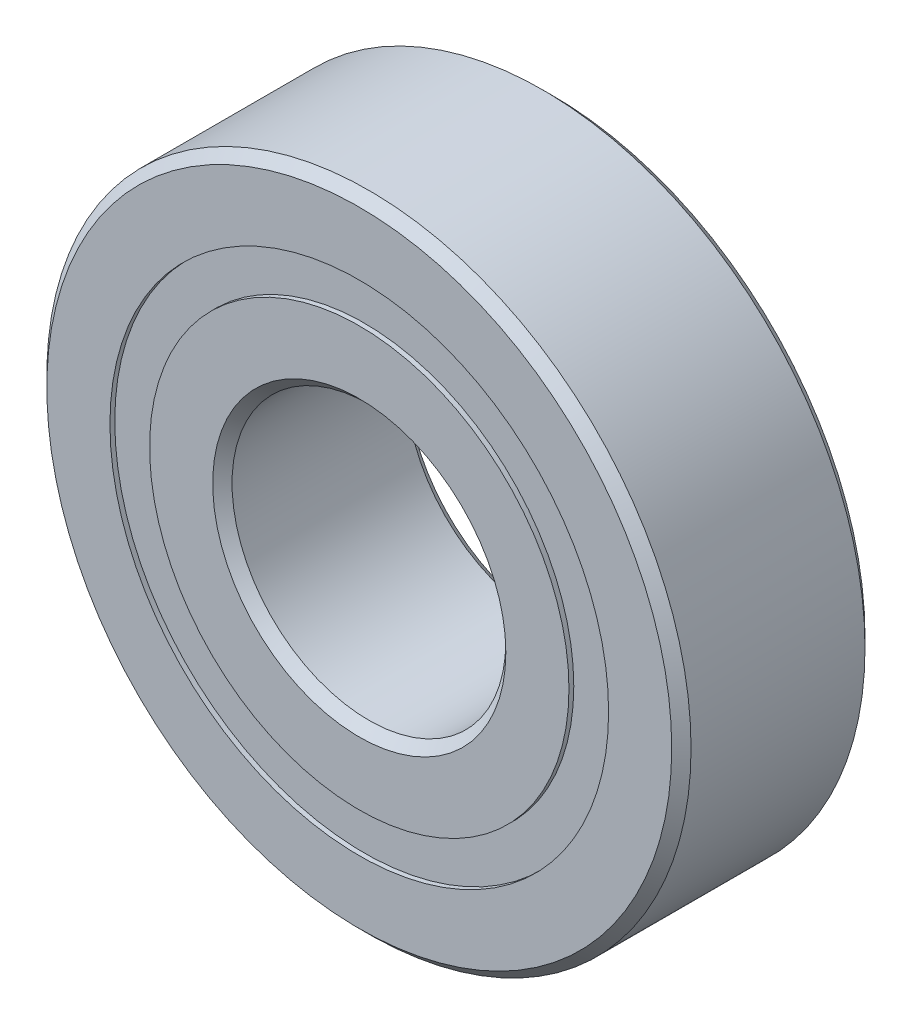
ISO-10303-21;
HEADER;
FILE_DESCRIPTION(('STEP AP214'),'2;1');
FILE_NAME('part.step','',(''),(''),'','','');
FILE_SCHEMA(('AUTOMOTIVE_DESIGN { 1 0 10303 214 1 1 1 1 }'));
ENDSEC;
DATA;
#1=APPLICATION_CONTEXT('core data for automotive mechanical design processes');
#2=APPLICATION_PROTOCOL_DEFINITION('international standard','automotive_design',2000,#1);
#3=PRODUCT_CONTEXT('',#1,'mechanical');
#4=PRODUCT('Part','Part','',(#3));
#5=PRODUCT_RELATED_PRODUCT_CATEGORY('part','',(#4));
#6=PRODUCT_DEFINITION_FORMATION('','',#4);
#7=PRODUCT_DEFINITION_CONTEXT('part definition',#1,'design');
#8=PRODUCT_DEFINITION('design','',#6,#7);
#9=PRODUCT_DEFINITION_SHAPE('','',#8);
#10=(LENGTH_UNIT() NAMED_UNIT(*) SI_UNIT(.MILLI.,.METRE.));
#11=(NAMED_UNIT(*) PLANE_ANGLE_UNIT() SI_UNIT($,.RADIAN.));
#12=(NAMED_UNIT(*) SI_UNIT($,.STERADIAN.) SOLID_ANGLE_UNIT());
#13=UNCERTAINTY_MEASURE_WITH_UNIT(LENGTH_MEASURE(1.E-05),#10,'distance_accuracy_value','');
#14=(GEOMETRIC_REPRESENTATION_CONTEXT(3) GLOBAL_UNCERTAINTY_ASSIGNED_CONTEXT((#13)) GLOBAL_UNIT_ASSIGNED_CONTEXT((#10,
#11,#12)) REPRESENTATION_CONTEXT('',''));
#15=CARTESIAN_POINT('',(0.,0.,0.));
#16=DIRECTION('',(0.,0.,1.));
#17=DIRECTION('',(1.,0.,0.));
#18=AXIS2_PLACEMENT_3D('',#15,#16,#17);
#19=CARTESIAN_POINT('',(0.,15.4807692307692,-5.70000000000001));
#20=DIRECTION('',(0.,0.,1.));
#21=DIRECTION('',(1.,0.,0.));
#22=AXIS2_PLACEMENT_3D('',#19,#20,#21);
#23=PLANE('',#22);
#24=CARTESIAN_POINT('',(0.,0.,-5.70000000000001));
#25=DIRECTION('',(0.,0.,1.));
#26=DIRECTION('',(1.,0.,0.));
#27=AXIS2_PLACEMENT_3D('',#24,#25,#26);
#28=CIRCLE('',#27,15.4807692307692);
#29=CARTESIAN_POINT('',(15.4807692307692,0.,-5.70000000000001));
#30=VERTEX_POINT('',#29);
#31=EDGE_CURVE('E58',#30,#30,#28,.T.);
#32=ORIENTED_EDGE('',*,*,#31,.F.);
#33=EDGE_LOOP('',(#32));
#34=FACE_BOUND('',#33,.T.);
#35=CARTESIAN_POINT('',(0.,0.,-5.70000000000001));
#36=DIRECTION('',(0.,0.,1.));
#37=DIRECTION('',(1.,0.,0.));
#38=AXIS2_PLACEMENT_3D('',#35,#36,#37);
#39=CIRCLE('',#38,13.0192307692308);
#40=CARTESIAN_POINT('',(13.0192307692308,0.,-5.70000000000001));
#41=VERTEX_POINT('',#40);
#42=EDGE_CURVE('E11',#41,#41,#39,.T.);
#43=ORIENTED_EDGE('',*,*,#42,.T.);
#44=EDGE_LOOP('',(#43));
#45=FACE_BOUND('',#44,.T.);
#46=ADVANCED_FACE('F44',(#34,#45),#23,.F.);
#47=CARTESIAN_POINT('',(0.,0.,6.));
#48=DIRECTION('',(0.,0.,1.));
#49=DIRECTION('',(1.,0.,0.));
#50=AXIS2_PLACEMENT_3D('',#47,#48,#49);
#51=CYLINDRICAL_SURFACE('',#50,13.0192307692308);
#52=ORIENTED_EDGE('',*,*,#42,.F.);
#53=EDGE_LOOP('',(#52));
#54=FACE_BOUND('',#53,.T.);
#55=CARTESIAN_POINT('',(0.,0.,-2.93698893605669));
#56=DIRECTION('',(0.,0.,1.));
#57=DIRECTION('',(1.,0.,0.));
#58=AXIS2_PLACEMENT_3D('',#55,#56,#57);
#59=CIRCLE('',#58,13.0192307692308);
#60=CARTESIAN_POINT('',(13.0192307692308,0.,-2.93698893605669));
#61=VERTEX_POINT('',#60);
#62=EDGE_CURVE('E50',#61,#61,#59,.T.);
#63=ORIENTED_EDGE('',*,*,#62,.T.);
#64=EDGE_LOOP('',(#63));
#65=FACE_BOUND('',#64,.T.);
#66=ADVANCED_FACE('F67',(#54,#65),#51,.F.);
#67=CARTESIAN_POINT('',(0.,15.4807692307692,-2.93698893605669));
#68=DIRECTION('',(0.,0.,-1.));
#69=DIRECTION('',(-1.,0.,0.));
#70=AXIS2_PLACEMENT_3D('',#67,#68,#69);
#71=PLANE('',#70);
#72=ORIENTED_EDGE('',*,*,#62,.F.);
#73=EDGE_LOOP('',(#72));
#74=FACE_BOUND('',#73,.T.);
#75=CARTESIAN_POINT('',(0.,0.,-2.93698893605669));
#76=DIRECTION('',(0.,0.,1.));
#77=DIRECTION('',(1.,0.,0.));
#78=AXIS2_PLACEMENT_3D('',#75,#76,#77);
#79=CIRCLE('',#78,15.4807692307692);
#80=CARTESIAN_POINT('',(15.4807692307692,0.,-2.93698893605669));
#81=VERTEX_POINT('',#80);
#82=EDGE_CURVE('E54',#81,#81,#79,.T.);
#83=ORIENTED_EDGE('',*,*,#82,.T.);
#84=EDGE_LOOP('',(#83));
#85=FACE_BOUND('',#84,.T.);
#86=ADVANCED_FACE('F71',(#74,#85),#71,.F.);
#87=CARTESIAN_POINT('',(0.,0.,6.));
#88=DIRECTION('',(0.,0.,1.));
#89=DIRECTION('',(1.,0.,0.));
#90=AXIS2_PLACEMENT_3D('',#87,#88,#89);
#91=CYLINDRICAL_SURFACE('',#90,15.4807692307692);
#92=ORIENTED_EDGE('',*,*,#82,.F.);
#93=EDGE_LOOP('',(#92));
#94=FACE_BOUND('',#93,.T.);
#95=ORIENTED_EDGE('',*,*,#31,.T.);
#96=EDGE_LOOP('',(#95));
#97=FACE_BOUND('',#96,.T.);
#98=ADVANCED_FACE('F64',(#94,#97),#91,.T.);
#99=CLOSED_SHELL('',(#46,#66,#86,#98));
#100=MANIFOLD_SOLID_BREP('B2',#99);
#101=CARTESIAN_POINT('',(0.,15.4807692307692,5.7));
#102=DIRECTION('',(0.,0.,-1.));
#103=DIRECTION('',(-1.,0.,0.));
#104=AXIS2_PLACEMENT_3D('',#101,#102,#103);
#105=PLANE('',#104);
#106=CARTESIAN_POINT('',(0.,0.,5.7));
#107=DIRECTION('',(0.,0.,1.));
#108=DIRECTION('',(1.,0.,0.));
#109=AXIS2_PLACEMENT_3D('',#106,#107,#108);
#110=CIRCLE('',#109,13.0192307692308);
#111=CARTESIAN_POINT('',(13.0192307692308,0.,5.7));
#112=VERTEX_POINT('',#111);
#113=EDGE_CURVE('E43',#112,#112,#110,.T.);
#114=ORIENTED_EDGE('',*,*,#113,.F.);
#115=EDGE_LOOP('',(#114));
#116=FACE_BOUND('',#115,.T.);
#117=CARTESIAN_POINT('',(0.,0.,5.7));
#118=DIRECTION('',(0.,0.,1.));
#119=DIRECTION('',(1.,0.,0.));
#120=AXIS2_PLACEMENT_3D('',#117,#118,#119);
#121=CIRCLE('',#120,15.4807692307692);
#122=CARTESIAN_POINT('',(15.4807692307692,0.,5.7));
#123=VERTEX_POINT('',#122);
#124=EDGE_CURVE('E126',#123,#123,#121,.T.);
#125=ORIENTED_EDGE('',*,*,#124,.T.);
#126=EDGE_LOOP('',(#125));
#127=FACE_BOUND('',#126,.T.);
#128=ADVANCED_FACE('F112',(#116,#127),#105,.F.);
#129=CARTESIAN_POINT('',(0.,0.,6.));
#130=DIRECTION('',(0.,0.,1.));
#131=DIRECTION('',(1.,0.,0.));
#132=AXIS2_PLACEMENT_3D('',#129,#130,#131);
#133=CYLINDRICAL_SURFACE('',#132,13.0192307692308);
#134=CARTESIAN_POINT('',(0.,0.,2.93698893605668));
#135=DIRECTION('',(0.,0.,1.));
#136=DIRECTION('',(1.,0.,0.));
#137=AXIS2_PLACEMENT_3D('',#134,#135,#136);
#138=CIRCLE('',#137,13.0192307692308);
#139=CARTESIAN_POINT('',(13.0192307692308,0.,2.93698893605668));
#140=VERTEX_POINT('',#139);
#141=EDGE_CURVE('E118',#140,#140,#138,.T.);
#142=ORIENTED_EDGE('',*,*,#141,.F.);
#143=EDGE_LOOP('',(#142));
#144=FACE_BOUND('',#143,.T.);
#145=ORIENTED_EDGE('',*,*,#113,.T.);
#146=EDGE_LOOP('',(#145));
#147=FACE_BOUND('',#146,.T.);
#148=ADVANCED_FACE('F141',(#144,#147),#133,.F.);
#149=CARTESIAN_POINT('',(0.,15.4807692307692,2.93698893605668));
#150=DIRECTION('',(0.,0.,1.));
#151=DIRECTION('',(1.,0.,0.));
#152=AXIS2_PLACEMENT_3D('',#149,#150,#151);
#153=PLANE('',#152);
#154=CARTESIAN_POINT('',(0.,0.,2.93698893605668));
#155=DIRECTION('',(0.,0.,1.));
#156=DIRECTION('',(1.,0.,0.));
#157=AXIS2_PLACEMENT_3D('',#154,#155,#156);
#158=CIRCLE('',#157,15.4807692307692);
#159=CARTESIAN_POINT('',(15.4807692307692,0.,2.93698893605668));
#160=VERTEX_POINT('',#159);
#161=EDGE_CURVE('E122',#160,#160,#158,.T.);
#162=ORIENTED_EDGE('',*,*,#161,.F.);
#163=EDGE_LOOP('',(#162));
#164=FACE_BOUND('',#163,.T.);
#165=ORIENTED_EDGE('',*,*,#141,.T.);
#166=EDGE_LOOP('',(#165));
#167=FACE_BOUND('',#166,.T.);
#168=ADVANCED_FACE('F136',(#164,#167),#153,.F.);
#169=CARTESIAN_POINT('',(0.,0.,6.));
#170=DIRECTION('',(0.,0.,1.));
#171=DIRECTION('',(1.,0.,0.));
#172=AXIS2_PLACEMENT_3D('',#169,#170,#171);
#173=CYLINDRICAL_SURFACE('',#172,15.4807692307692);
#174=ORIENTED_EDGE('',*,*,#124,.F.);
#175=EDGE_LOOP('',(#174));
#176=FACE_BOUND('',#175,.T.);
#177=ORIENTED_EDGE('',*,*,#161,.T.);
#178=EDGE_LOOP('',(#177));
#179=FACE_BOUND('',#178,.T.);
#180=ADVANCED_FACE('F133',(#176,#179),#173,.T.);
#181=CLOSED_SHELL('',(#128,#148,#168,#180));
#182=MANIFOLD_SOLID_BREP('B6',#181);
#183=CARTESIAN_POINT('',(-6.18284328242503,12.8388063676096,0.));
#184=DIRECTION('',(0.,0.,1.));
#185=DIRECTION('',(-0.433883739117546,0.900968867902425,0.));
#186=AXIS2_PLACEMENT_3D('',#183,#184,#185);
#187=SPHERICAL_SURFACE('',#186,2.93698893605669);
#188=CARTESIAN_POINT('',(-6.18284328242503,12.8388063676096,2.93698893605668));
#189=VERTEX_POINT('',#188);
#190=VERTEX_LOOP('',#189);
#191=FACE_BOUND('',#190,.T.);
#192=ADVANCED_FACE('F180',(#191),#187,.T.);
#193=CLOSED_SHELL('',(#192));
#194=MANIFOLD_SOLID_BREP('B38',#193);
#195=CARTESIAN_POINT('',(-11.1410986251693,8.88472967648709,0.));
#196=DIRECTION('',(0.,0.,1.));
#197=DIRECTION('',(-0.781831482468022,0.623489801858743,0.));
#198=AXIS2_PLACEMENT_3D('',#195,#196,#197);
#199=SPHERICAL_SURFACE('',#198,2.93698893605669);
#200=CARTESIAN_POINT('',(-11.1410986251693,8.88472967648709,2.93698893605668));
#201=VERTEX_POINT('',#200);
#202=VERTEX_LOOP('',#201);
#203=FACE_BOUND('',#202,.T.);
#204=ADVANCED_FACE('F201',(#203),#199,.T.);
#205=CLOSED_SHELL('',(#204));
#206=MANIFOLD_SOLID_BREP('B108',#205);
#207=CARTESIAN_POINT('',(-13.892722748591,3.17092330887763,0.));
#208=DIRECTION('',(0.,0.,1.));
#209=DIRECTION('',(-0.974927912181821,0.222520933956325,0.));
#210=AXIS2_PLACEMENT_3D('',#207,#208,#209);
#211=SPHERICAL_SURFACE('',#210,2.93698893605669);
#212=CARTESIAN_POINT('',(-13.892722748591,3.17092330887763,2.93698893605668));
#213=VERTEX_POINT('',#212);
#214=VERTEX_LOOP('',#213);
#215=FACE_BOUND('',#214,.T.);
#216=ADVANCED_FACE('F222',(#215),#211,.T.);
#217=CLOSED_SHELL('',(#216));
#218=MANIFOLD_SOLID_BREP('B176',#217);
#219=CARTESIAN_POINT('',(-13.892722748591,-3.17092330887735,0.));
#220=DIRECTION('',(0.,0.,1.));
#221=DIRECTION('',(-0.974927912181826,-0.222520933956305,0.));
#222=AXIS2_PLACEMENT_3D('',#219,#220,#221);
#223=SPHERICAL_SURFACE('',#222,2.93698893605669);
#224=CARTESIAN_POINT('',(-13.892722748591,-3.17092330887735,2.93698893605668));
#225=VERTEX_POINT('',#224);
#226=VERTEX_LOOP('',#225);
#227=FACE_BOUND('',#226,.T.);
#228=ADVANCED_FACE('F243',(#227),#223,.T.);
#229=CLOSED_SHELL('',(#228));
#230=MANIFOLD_SOLID_BREP('B197',#229);
#231=CARTESIAN_POINT('',(-11.1410986251695,-8.88472967648686,0.));
#232=DIRECTION('',(0.,0.,1.));
#233=DIRECTION('',(-0.781831482468035,-0.623489801858727,0.));
#234=AXIS2_PLACEMENT_3D('',#231,#232,#233);
#235=SPHERICAL_SURFACE('',#234,2.93698893605669);
#236=CARTESIAN_POINT('',(-11.1410986251695,-8.88472967648686,2.93698893605668));
#237=VERTEX_POINT('',#236);
#238=VERTEX_LOOP('',#237);
#239=FACE_BOUND('',#238,.T.);
#240=ADVANCED_FACE('F264',(#239),#235,.T.);
#241=CLOSED_SHELL('',(#240));
#242=MANIFOLD_SOLID_BREP('B218',#241);
#243=CARTESIAN_POINT('',(-6.1828432824253,-12.8388063676094,0.));
#244=DIRECTION('',(0.,0.,1.));
#245=DIRECTION('',(-0.433883739117565,-0.900968867902416,0.));
#246=AXIS2_PLACEMENT_3D('',#243,#244,#245);
#247=SPHERICAL_SURFACE('',#246,2.93698893605669);
#248=CARTESIAN_POINT('',(-6.1828432824253,-12.8388063676094,2.93698893605668));
#249=VERTEX_POINT('',#248);
#250=VERTEX_LOOP('',#249);
#251=FACE_BOUND('',#250,.T.);
#252=ADVANCED_FACE('F285',(#251),#247,.T.);
#253=CLOSED_SHELL('',(#252));
#254=MANIFOLD_SOLID_BREP('B239',#253);
#255=CARTESIAN_POINT('',(0.,-14.25,0.));
#256=DIRECTION('',(0.,0.,1.));
#257=DIRECTION('',(0.,-1.,0.));
#258=AXIS2_PLACEMENT_3D('',#255,#256,#257);
#259=SPHERICAL_SURFACE('',#258,2.93698893605669);
#260=CARTESIAN_POINT('',(0.,-14.25,2.93698893605668));
#261=VERTEX_POINT('',#260);
#262=VERTEX_LOOP('',#261);
#263=FACE_BOUND('',#262,.T.);
#264=ADVANCED_FACE('F306',(#263),#259,.T.);
#265=CLOSED_SHELL('',(#264));
#266=MANIFOLD_SOLID_BREP('B260',#265);
#267=CARTESIAN_POINT('',(6.18284328242512,-12.8388063676095,0.));
#268=DIRECTION('',(0.,0.,1.));
#269=DIRECTION('',(0.433883739117553,-0.900968867902422,0.));
#270=AXIS2_PLACEMENT_3D('',#267,#268,#269);
#271=SPHERICAL_SURFACE('',#270,2.93698893605669);
#272=CARTESIAN_POINT('',(6.18284328242512,-12.8388063676095,2.93698893605668));
#273=VERTEX_POINT('',#272);
#274=VERTEX_LOOP('',#273);
#275=FACE_BOUND('',#274,.T.);
#276=ADVANCED_FACE('F327',(#275),#271,.T.);
#277=CLOSED_SHELL('',(#276));
#278=MANIFOLD_SOLID_BREP('B281',#277);
#279=CARTESIAN_POINT('',(11.1410986251694,-8.88472967648701,0.));
#280=DIRECTION('',(0.,0.,1.));
#281=DIRECTION('',(0.781831482468027,-0.623489801858737,0.));
#282=AXIS2_PLACEMENT_3D('',#279,#280,#281);
#283=SPHERICAL_SURFACE('',#282,2.93698893605669);
#284=CARTESIAN_POINT('',(11.1410986251694,-8.88472967648701,2.93698893605668));
#285=VERTEX_POINT('',#284);
#286=VERTEX_LOOP('',#285);
#287=FACE_BOUND('',#286,.T.);
#288=ADVANCED_FACE('F348',(#287),#283,.T.);
#289=CLOSED_SHELL('',(#288));
#290=MANIFOLD_SOLID_BREP('B302',#289);
#291=CARTESIAN_POINT('',(13.892722748591,-3.17092330887753,0.));
#292=DIRECTION('',(0.,0.,1.));
#293=DIRECTION('',(0.974927912181823,-0.222520933956318,0.));
#294=AXIS2_PLACEMENT_3D('',#291,#292,#293);
#295=SPHERICAL_SURFACE('',#294,2.93698893605669);
#296=CARTESIAN_POINT('',(13.892722748591,-3.17092330887753,2.93698893605668));
#297=VERTEX_POINT('',#296);
#298=VERTEX_LOOP('',#297);
#299=FACE_BOUND('',#298,.T.);
#300=ADVANCED_FACE('F369',(#299),#295,.T.);
#301=CLOSED_SHELL('',(#300));
#302=MANIFOLD_SOLID_BREP('B323',#301);
#303=CARTESIAN_POINT('',(13.892722748591,3.17092330887744,0.));
#304=DIRECTION('',(0.,0.,1.));
#305=DIRECTION('',(0.974927912181824,0.222520933956311,0.));
#306=AXIS2_PLACEMENT_3D('',#303,#304,#305);
#307=SPHERICAL_SURFACE('',#306,2.93698893605669);
#308=CARTESIAN_POINT('',(13.892722748591,3.17092330887744,2.93698893605668));
#309=VERTEX_POINT('',#308);
#310=VERTEX_LOOP('',#309);
#311=FACE_BOUND('',#310,.T.);
#312=ADVANCED_FACE('F390',(#311),#307,.T.);
#313=CLOSED_SHELL('',(#312));
#314=MANIFOLD_SOLID_BREP('B344',#313);
#315=CARTESIAN_POINT('',(11.1410986251694,8.88472967648693,0.));
#316=DIRECTION('',(0.,0.,1.));
#317=DIRECTION('',(0.781831482468031,0.623489801858732,0.));
#318=AXIS2_PLACEMENT_3D('',#315,#316,#317);
#319=SPHERICAL_SURFACE('',#318,2.93698893605669);
#320=CARTESIAN_POINT('',(11.1410986251694,8.88472967648693,2.93698893605668));
#321=VERTEX_POINT('',#320);
#322=VERTEX_LOOP('',#321);
#323=FACE_BOUND('',#322,.T.);
#324=ADVANCED_FACE('F411',(#323),#319,.T.);
#325=CLOSED_SHELL('',(#324));
#326=MANIFOLD_SOLID_BREP('B365',#325);
#327=CARTESIAN_POINT('',(6.18284328242522,12.8388063676095,0.));
#328=DIRECTION('',(0.,0.,1.));
#329=DIRECTION('',(0.433883739117559,0.900968867902419,0.));
#330=AXIS2_PLACEMENT_3D('',#327,#328,#329);
#331=SPHERICAL_SURFACE('',#330,2.93698893605669);
#332=CARTESIAN_POINT('',(6.18284328242522,12.8388063676095,2.93698893605668));
#333=VERTEX_POINT('',#332);
#334=VERTEX_LOOP('',#333);
#335=FACE_BOUND('',#334,.T.);
#336=ADVANCED_FACE('F432',(#335),#331,.T.);
#337=CLOSED_SHELL('',(#336));
#338=MANIFOLD_SOLID_BREP('B386',#337);
#339=CARTESIAN_POINT('',(0.,14.25,0.));
#340=DIRECTION('',(0.,0.,1.));
#341=DIRECTION('',(0.,1.,0.));
#342=AXIS2_PLACEMENT_3D('',#339,#340,#341);
#343=SPHERICAL_SURFACE('',#342,2.93698893605669);
#344=CARTESIAN_POINT('',(0.,14.25,2.93698893605668));
#345=VERTEX_POINT('',#344);
#346=VERTEX_LOOP('',#345);
#347=FACE_BOUND('',#346,.T.);
#348=ADVANCED_FACE('F455',(#347),#343,.T.);
#349=CLOSED_SHELL('',(#348));
#350=MANIFOLD_SOLID_BREP('B407',#349);
#351=CARTESIAN_POINT('',(0.,13.0192307692308,6.00000000000001));
#352=DIRECTION('',(0.,0.,-1.));
#353=DIRECTION('',(-1.,0.,0.));
#354=AXIS2_PLACEMENT_3D('',#351,#352,#353);
#355=PLANE('',#354);
#356=CARTESIAN_POINT('',(0.,0.,6.));
#357=DIRECTION('',(0.,0.,1.));
#358=DIRECTION('',(1.,0.,0.));
#359=AXIS2_PLACEMENT_3D('',#356,#357,#358);
#360=CIRCLE('',#359,9.1);
#361=CARTESIAN_POINT('',(9.1,0.,6.));
#362=VERTEX_POINT('',#361);
#363=EDGE_CURVE('E503',#362,#362,#360,.T.);
#364=ORIENTED_EDGE('',*,*,#363,.F.);
#365=EDGE_LOOP('',(#364));
#366=FACE_BOUND('',#365,.T.);
#367=CARTESIAN_POINT('',(0.,0.,6.00000000000001));
#368=DIRECTION('',(0.,0.,1.));
#369=DIRECTION('',(1.,0.,0.));
#370=AXIS2_PLACEMENT_3D('',#367,#368,#369);
#371=CIRCLE('',#370,13.0192307692308);
#372=CARTESIAN_POINT('',(13.0192307692308,0.,6.00000000000001));
#373=VERTEX_POINT('',#372);
#374=EDGE_CURVE('E454',#373,#373,#371,.T.);
#375=ORIENTED_EDGE('',*,*,#374,.T.);
#376=EDGE_LOOP('',(#375));
#377=FACE_BOUND('',#376,.T.);
#378=ADVANCED_FACE('F475',(#366,#377),#355,.F.);
#379=CARTESIAN_POINT('',(0.,0.,6.));
#380=DIRECTION('',(0.,0.,1.));
#381=DIRECTION('',(1.,0.,0.));
#382=AXIS2_PLACEMENT_3D('',#379,#380,#381);
#383=CYLINDRICAL_SURFACE('',#382,13.0192307692308);
#384=ORIENTED_EDGE('',*,*,#374,.F.);
#385=EDGE_LOOP('',(#384));
#386=FACE_BOUND('',#385,.T.);
#387=CARTESIAN_POINT('',(0.,0.,2.66666666666666));
#388=DIRECTION('',(0.,0.,1.));
#389=DIRECTION('',(1.,0.,0.));
#390=AXIS2_PLACEMENT_3D('',#387,#388,#389);
#391=CIRCLE('',#390,13.0192307692308);
#392=CARTESIAN_POINT('',(13.0192307692308,0.,2.66666666666666));
#393=VERTEX_POINT('',#392);
#394=EDGE_CURVE('E481',#393,#393,#391,.T.);
#395=ORIENTED_EDGE('',*,*,#394,.T.);
#396=EDGE_LOOP('',(#395));
#397=FACE_BOUND('',#396,.T.);
#398=ADVANCED_FACE('F510',(#386,#397),#383,.T.);
#399=CARTESIAN_POINT('',(0.,0.,0.));
#400=DIRECTION('',(0.,0.,1.));
#401=DIRECTION('',(1.,0.,0.));
#402=AXIS2_PLACEMENT_3D('',#399,#400,#401);
#403=TOROIDAL_SURFACE('',#402,14.25,2.93698893605668);
#404=ORIENTED_EDGE('',*,*,#394,.F.);
#405=EDGE_LOOP('',(#404));
#406=FACE_BOUND('',#405,.T.);
#407=CARTESIAN_POINT('',(0.,0.,-2.66666666666667));
#408=DIRECTION('',(0.,0.,1.));
#409=DIRECTION('',(1.,0.,0.));
#410=AXIS2_PLACEMENT_3D('',#407,#408,#409);
#411=CIRCLE('',#410,13.0192307692308);
#412=CARTESIAN_POINT('',(13.0192307692308,0.,-2.66666666666667));
#413=VERTEX_POINT('',#412);
#414=EDGE_CURVE('E485',#413,#413,#411,.T.);
#415=ORIENTED_EDGE('',*,*,#414,.T.);
#416=EDGE_LOOP('',(#415));
#417=FACE_BOUND('',#416,.T.);
#418=ADVANCED_FACE('F514',(#406,#417),#403,.F.);
#419=CARTESIAN_POINT('',(0.,0.,6.));
#420=DIRECTION('',(0.,0.,1.));
#421=DIRECTION('',(1.,0.,0.));
#422=AXIS2_PLACEMENT_3D('',#419,#420,#421);
#423=CYLINDRICAL_SURFACE('',#422,13.0192307692308);
#424=ORIENTED_EDGE('',*,*,#414,.F.);
#425=EDGE_LOOP('',(#424));
#426=FACE_BOUND('',#425,.T.);
#427=CARTESIAN_POINT('',(0.,0.,-6.00000000000001));
#428=DIRECTION('',(0.,0.,1.));
#429=DIRECTION('',(1.,0.,0.));
#430=AXIS2_PLACEMENT_3D('',#427,#428,#429);
#431=CIRCLE('',#430,13.0192307692308);
#432=CARTESIAN_POINT('',(13.0192307692308,0.,-6.00000000000001));
#433=VERTEX_POINT('',#432);
#434=EDGE_CURVE('E489',#433,#433,#431,.T.);
#435=ORIENTED_EDGE('',*,*,#434,.T.);
#436=EDGE_LOOP('',(#435));
#437=FACE_BOUND('',#436,.T.);
#438=ADVANCED_FACE('F519',(#426,#437),#423,.T.);
#439=CARTESIAN_POINT('',(0.,9.1,-6.00000000000001));
#440=DIRECTION('',(0.,0.,1.));
#441=DIRECTION('',(1.,0.,0.));
#442=AXIS2_PLACEMENT_3D('',#439,#440,#441);
#443=PLANE('',#442);
#444=ORIENTED_EDGE('',*,*,#434,.F.);
#445=EDGE_LOOP('',(#444));
#446=FACE_BOUND('',#445,.T.);
#447=CARTESIAN_POINT('',(0.,0.,-6.00000000000001));
#448=DIRECTION('',(0.,0.,1.));
#449=DIRECTION('',(1.,0.,0.));
#450=AXIS2_PLACEMENT_3D('',#447,#448,#449);
#451=CIRCLE('',#450,9.1);
#452=CARTESIAN_POINT('',(9.1,0.,-6.00000000000001));
#453=VERTEX_POINT('',#452);
#454=EDGE_CURVE('E494',#453,#453,#451,.T.);
#455=ORIENTED_EDGE('',*,*,#454,.T.);
#456=EDGE_LOOP('',(#455));
#457=FACE_BOUND('',#456,.T.);
#458=ADVANCED_FACE('F525',(#446,#457),#443,.F.);
#459=CARTESIAN_POINT('',(0.,0.,-5.40000000000001));
#460=DIRECTION('',(0.,0.,-1.));
#461=DIRECTION('',(-1.,0.,0.));
#462=AXIS2_PLACEMENT_3D('',#459,#460,#461);
#463=CONICAL_SURFACE('',#462,8.5,0.785398163397444);
#464=ORIENTED_EDGE('',*,*,#454,.F.);
#465=EDGE_LOOP('',(#464));
#466=FACE_BOUND('',#465,.T.);
#467=CARTESIAN_POINT('',(0.,0.,-5.40000000000001));
#468=DIRECTION('',(0.,0.,1.));
#469=DIRECTION('',(1.,0.,0.));
#470=AXIS2_PLACEMENT_3D('',#467,#468,#469);
#471=CIRCLE('',#470,8.5);
#472=CARTESIAN_POINT('',(8.5,0.,-5.40000000000001));
#473=VERTEX_POINT('',#472);
#474=EDGE_CURVE('E497',#473,#473,#471,.T.);
#475=ORIENTED_EDGE('',*,*,#474,.T.);
#476=EDGE_LOOP('',(#475));
#477=FACE_BOUND('',#476,.T.);
#478=ADVANCED_FACE('F529',(#466,#477),#463,.F.);
#479=CARTESIAN_POINT('',(0.,0.,6.));
#480=DIRECTION('',(0.,0.,1.));
#481=DIRECTION('',(1.,0.,0.));
#482=AXIS2_PLACEMENT_3D('',#479,#480,#481);
#483=CYLINDRICAL_SURFACE('',#482,8.5);
#484=ORIENTED_EDGE('',*,*,#474,.F.);
#485=EDGE_LOOP('',(#484));
#486=FACE_BOUND('',#485,.T.);
#487=CARTESIAN_POINT('',(0.,0.,5.4));
#488=DIRECTION('',(0.,0.,1.));
#489=DIRECTION('',(1.,0.,0.));
#490=AXIS2_PLACEMENT_3D('',#487,#488,#489);
#491=CIRCLE('',#490,8.5);
#492=CARTESIAN_POINT('',(8.5,0.,5.4));
#493=VERTEX_POINT('',#492);
#494=EDGE_CURVE('E500',#493,#493,#491,.T.);
#495=ORIENTED_EDGE('',*,*,#494,.T.);
#496=EDGE_LOOP('',(#495));
#497=FACE_BOUND('',#496,.T.);
#498=ADVANCED_FACE('F533',(#486,#497),#483,.F.);
#499=CARTESIAN_POINT('',(0.,0.,6.));
#500=DIRECTION('',(0.,0.,1.));
#501=DIRECTION('',(1.,0.,0.));
#502=AXIS2_PLACEMENT_3D('',#499,#500,#501);
#503=CONICAL_SURFACE('',#502,9.1,0.785398163397453);
#504=ORIENTED_EDGE('',*,*,#494,.F.);
#505=EDGE_LOOP('',(#504));
#506=FACE_BOUND('',#505,.T.);
#507=ORIENTED_EDGE('',*,*,#363,.T.);
#508=EDGE_LOOP('',(#507));
#509=FACE_BOUND('',#508,.T.);
#510=ADVANCED_FACE('F507',(#506,#509),#503,.F.);
#511=CLOSED_SHELL('',(#378,#398,#418,#438,#458,#478,#498,#510));
#512=MANIFOLD_SOLID_BREP('B428',#511);
#513=CARTESIAN_POINT('',(0.,0.,5.4));
#514=DIRECTION('',(0.,0.,-1.));
#515=DIRECTION('',(-1.,0.,0.));
#516=AXIS2_PLACEMENT_3D('',#513,#514,#515);
#517=CONICAL_SURFACE('',#516,20.,0.785398163397448);
#518=CARTESIAN_POINT('',(0.,0.,6.));
#519=DIRECTION('',(0.,0.,1.));
#520=DIRECTION('',(1.,0.,0.));
#521=AXIS2_PLACEMENT_3D('',#518,#519,#520);
#522=CIRCLE('',#521,19.4);
#523=CARTESIAN_POINT('',(19.4,0.,6.));
#524=VERTEX_POINT('',#523);
#525=EDGE_CURVE('E625',#524,#524,#522,.T.);
#526=ORIENTED_EDGE('',*,*,#525,.F.);
#527=EDGE_LOOP('',(#526));
#528=FACE_BOUND('',#527,.T.);
#529=CARTESIAN_POINT('',(0.,0.,5.4));
#530=DIRECTION('',(0.,0.,1.));
#531=DIRECTION('',(1.,0.,0.));
#532=AXIS2_PLACEMENT_3D('',#529,#530,#531);
#533=CIRCLE('',#532,20.);
#534=CARTESIAN_POINT('',(20.,0.,5.4));
#535=VERTEX_POINT('',#534);
#536=EDGE_CURVE('E474',#535,#535,#533,.T.);
#537=ORIENTED_EDGE('',*,*,#536,.T.);
#538=EDGE_LOOP('',(#537));
#539=FACE_BOUND('',#538,.T.);
#540=ADVANCED_FACE('F597',(#528,#539),#517,.T.);
#541=CARTESIAN_POINT('',(0.,0.,6.));
#542=DIRECTION('',(0.,0.,1.));
#543=DIRECTION('',(1.,0.,0.));
#544=AXIS2_PLACEMENT_3D('',#541,#542,#543);
#545=CYLINDRICAL_SURFACE('',#544,20.);
#546=ORIENTED_EDGE('',*,*,#536,.F.);
#547=EDGE_LOOP('',(#546));
#548=FACE_BOUND('',#547,.T.);
#549=CARTESIAN_POINT('',(0.,0.,-5.40000000000001));
#550=DIRECTION('',(0.,0.,1.));
#551=DIRECTION('',(1.,0.,0.));
#552=AXIS2_PLACEMENT_3D('',#549,#550,#551);
#553=CIRCLE('',#552,20.);
#554=CARTESIAN_POINT('',(20.,0.,-5.40000000000001));
#555=VERTEX_POINT('',#554);
#556=EDGE_CURVE('E603',#555,#555,#553,.T.);
#557=ORIENTED_EDGE('',*,*,#556,.T.);
#558=EDGE_LOOP('',(#557));
#559=FACE_BOUND('',#558,.T.);
#560=ADVANCED_FACE('F632',(#548,#559),#545,.T.);
#561=CARTESIAN_POINT('',(0.,0.,-6.00000000000001));
#562=DIRECTION('',(0.,0.,1.));
#563=DIRECTION('',(1.,0.,0.));
#564=AXIS2_PLACEMENT_3D('',#561,#562,#563);
#565=CONICAL_SURFACE('',#564,19.4,0.785398163397448);
#566=ORIENTED_EDGE('',*,*,#556,.F.);
#567=EDGE_LOOP('',(#566));
#568=FACE_BOUND('',#567,.T.);
#569=CARTESIAN_POINT('',(0.,0.,-6.00000000000001));
#570=DIRECTION('',(0.,0.,1.));
#571=DIRECTION('',(1.,0.,0.));
#572=AXIS2_PLACEMENT_3D('',#569,#570,#571);
#573=CIRCLE('',#572,19.4);
#574=CARTESIAN_POINT('',(19.4,0.,-6.00000000000001));
#575=VERTEX_POINT('',#574);
#576=EDGE_CURVE('E607',#575,#575,#573,.T.);
#577=ORIENTED_EDGE('',*,*,#576,.T.);
#578=EDGE_LOOP('',(#577));
#579=FACE_BOUND('',#578,.T.);
#580=ADVANCED_FACE('F636',(#568,#579),#565,.T.);
#581=CARTESIAN_POINT('',(0.,19.4,-6.00000000000001));
#582=DIRECTION('',(0.,0.,1.));
#583=DIRECTION('',(1.,0.,0.));
#584=AXIS2_PLACEMENT_3D('',#581,#582,#583);
#585=PLANE('',#584);
#586=ORIENTED_EDGE('',*,*,#576,.F.);
#587=EDGE_LOOP('',(#586));
#588=FACE_BOUND('',#587,.T.);
#589=CARTESIAN_POINT('',(0.,0.,-6.00000000000001));
#590=DIRECTION('',(0.,0.,1.));
#591=DIRECTION('',(1.,0.,0.));
#592=AXIS2_PLACEMENT_3D('',#589,#590,#591);
#593=CIRCLE('',#592,15.4807692307692);
#594=CARTESIAN_POINT('',(15.4807692307692,0.,-6.00000000000001));
#595=VERTEX_POINT('',#594);
#596=EDGE_CURVE('E611',#595,#595,#593,.T.);
#597=ORIENTED_EDGE('',*,*,#596,.T.);
#598=EDGE_LOOP('',(#597));
#599=FACE_BOUND('',#598,.T.);
#600=ADVANCED_FACE('F641',(#588,#599),#585,.F.);
#601=CARTESIAN_POINT('',(0.,0.,6.));
#602=DIRECTION('',(0.,0.,1.));
#603=DIRECTION('',(1.,0.,0.));
#604=AXIS2_PLACEMENT_3D('',#601,#602,#603);
#605=CYLINDRICAL_SURFACE('',#604,15.4807692307692);
#606=ORIENTED_EDGE('',*,*,#596,.F.);
#607=EDGE_LOOP('',(#606));
#608=FACE_BOUND('',#607,.T.);
#609=CARTESIAN_POINT('',(0.,0.,-2.66666666666667));
#610=DIRECTION('',(0.,0.,1.));
#611=DIRECTION('',(1.,0.,0.));
#612=AXIS2_PLACEMENT_3D('',#609,#610,#611);
#613=CIRCLE('',#612,15.4807692307692);
#614=CARTESIAN_POINT('',(15.4807692307692,0.,-2.66666666666667));
#615=VERTEX_POINT('',#614);
#616=EDGE_CURVE('E616',#615,#615,#613,.T.);
#617=ORIENTED_EDGE('',*,*,#616,.T.);
#618=EDGE_LOOP('',(#617));
#619=FACE_BOUND('',#618,.T.);
#620=ADVANCED_FACE('F647',(#608,#619),#605,.F.);
#621=CARTESIAN_POINT('',(0.,0.,0.));
#622=DIRECTION('',(0.,0.,1.));
#623=DIRECTION('',(1.,0.,0.));
#624=AXIS2_PLACEMENT_3D('',#621,#622,#623);
#625=TOROIDAL_SURFACE('',#624,14.25,2.93698893605669);
#626=ORIENTED_EDGE('',*,*,#616,.F.);
#627=EDGE_LOOP('',(#626));
#628=FACE_BOUND('',#627,.T.);
#629=CARTESIAN_POINT('',(0.,0.,2.66666666666666));
#630=DIRECTION('',(0.,0.,1.));
#631=DIRECTION('',(1.,0.,0.));
#632=AXIS2_PLACEMENT_3D('',#629,#630,#631);
#633=CIRCLE('',#632,15.4807692307692);
#634=CARTESIAN_POINT('',(15.4807692307692,0.,2.66666666666666));
#635=VERTEX_POINT('',#634);
#636=EDGE_CURVE('E619',#635,#635,#633,.T.);
#637=ORIENTED_EDGE('',*,*,#636,.T.);
#638=EDGE_LOOP('',(#637));
#639=FACE_BOUND('',#638,.T.);
#640=ADVANCED_FACE('F651',(#628,#639),#625,.F.);
#641=CARTESIAN_POINT('',(0.,0.,6.));
#642=DIRECTION('',(0.,0.,1.));
#643=DIRECTION('',(1.,0.,0.));
#644=AXIS2_PLACEMENT_3D('',#641,#642,#643);
#645=CYLINDRICAL_SURFACE('',#644,15.4807692307692);
#646=ORIENTED_EDGE('',*,*,#636,.F.);
#647=EDGE_LOOP('',(#646));
#648=FACE_BOUND('',#647,.T.);
#649=CARTESIAN_POINT('',(0.,0.,6.));
#650=DIRECTION('',(0.,0.,1.));
#651=DIRECTION('',(1.,0.,0.));
#652=AXIS2_PLACEMENT_3D('',#649,#650,#651);
#653=CIRCLE('',#652,15.4807692307692);
#654=CARTESIAN_POINT('',(15.4807692307692,0.,6.));
#655=VERTEX_POINT('',#654);
#656=EDGE_CURVE('E622',#655,#655,#653,.T.);
#657=ORIENTED_EDGE('',*,*,#656,.T.);
#658=EDGE_LOOP('',(#657));
#659=FACE_BOUND('',#658,.T.);
#660=ADVANCED_FACE('F655',(#648,#659),#645,.F.);
#661=CARTESIAN_POINT('',(0.,19.4,6.));
#662=DIRECTION('',(0.,0.,-1.));
#663=DIRECTION('',(-1.,0.,0.));
#664=AXIS2_PLACEMENT_3D('',#661,#662,#663);
#665=PLANE('',#664);
#666=ORIENTED_EDGE('',*,*,#656,.F.);
#667=EDGE_LOOP('',(#666));
#668=FACE_BOUND('',#667,.T.);
#669=ORIENTED_EDGE('',*,*,#525,.T.);
#670=EDGE_LOOP('',(#669));
#671=FACE_BOUND('',#670,.T.);
#672=ADVANCED_FACE('F629',(#668,#671),#665,.F.);
#673=CLOSED_SHELL('',(#540,#560,#580,#600,#620,#640,#660,#672));
#674=MANIFOLD_SOLID_BREP('B449',#673);
#675=ADVANCED_BREP_SHAPE_REPRESENTATION('',(#18,#100,#182,#194,#206,#218,#230,#242,#254,#266,
#278,#290,#302,#314,#326,#338,#350,#512,#674),#14);
#676=SHAPE_DEFINITION_REPRESENTATION(#9,#675);
ENDSEC;
END-ISO-10303-21;
